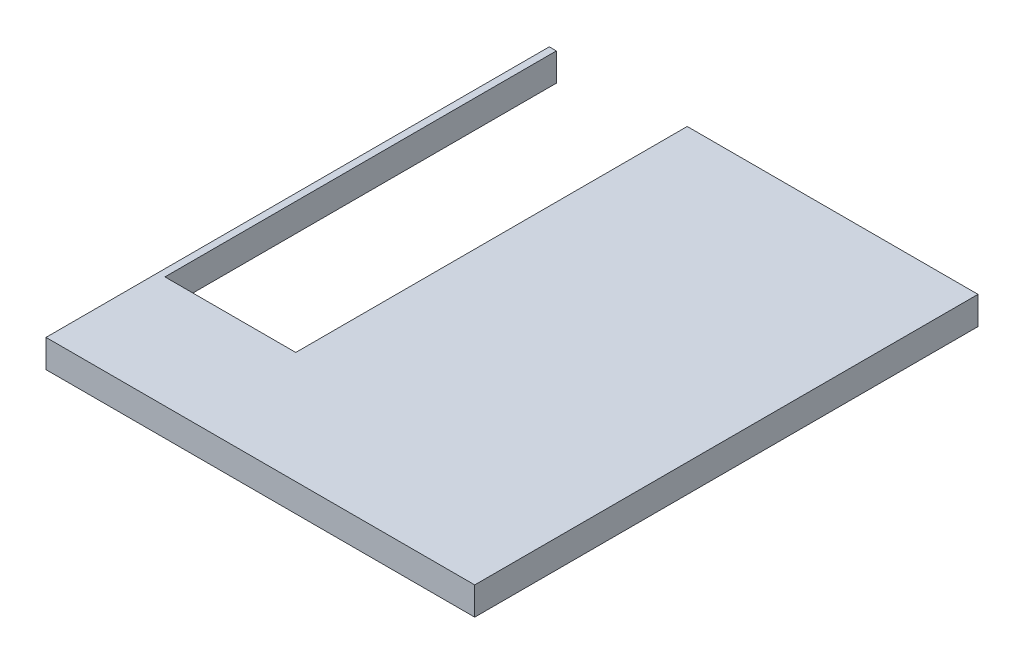
ISO-10303-21;
HEADER;
FILE_DESCRIPTION(('STEP AP214'),'2;1');
FILE_NAME('part.step','',(''),(''),'','','');
FILE_SCHEMA(('AUTOMOTIVE_DESIGN { 1 0 10303 214 1 1 1 1 }'));
ENDSEC;
DATA;
#1=APPLICATION_CONTEXT('core data for automotive mechanical design processes');
#2=APPLICATION_PROTOCOL_DEFINITION('international standard','automotive_design',2000,#1);
#3=PRODUCT_CONTEXT('',#1,'mechanical');
#4=PRODUCT('Part','Part','',(#3));
#5=PRODUCT_RELATED_PRODUCT_CATEGORY('part','',(#4));
#6=PRODUCT_DEFINITION_FORMATION('','',#4);
#7=PRODUCT_DEFINITION_CONTEXT('part definition',#1,'design');
#8=PRODUCT_DEFINITION('design','',#6,#7);
#9=PRODUCT_DEFINITION_SHAPE('','',#8);
#10=(LENGTH_UNIT() NAMED_UNIT(*) SI_UNIT(.MILLI.,.METRE.));
#11=(NAMED_UNIT(*) PLANE_ANGLE_UNIT() SI_UNIT($,.RADIAN.));
#12=(NAMED_UNIT(*) SI_UNIT($,.STERADIAN.) SOLID_ANGLE_UNIT());
#13=UNCERTAINTY_MEASURE_WITH_UNIT(LENGTH_MEASURE(1.E-05),#10,'distance_accuracy_value','');
#14=(GEOMETRIC_REPRESENTATION_CONTEXT(3) GLOBAL_UNCERTAINTY_ASSIGNED_CONTEXT((#13)) GLOBAL_UNIT_ASSIGNED_CONTEXT((#10,
#11,#12)) REPRESENTATION_CONTEXT('',''));
#15=CARTESIAN_POINT('',(0.,0.,0.));
#16=DIRECTION('',(0.,0.,1.));
#17=DIRECTION('',(1.,0.,0.));
#18=AXIS2_PLACEMENT_3D('',#15,#16,#17);
#19=CARTESIAN_POINT('',(0.,0.,0.));
#20=DIRECTION('',(0.,0.,-1.));
#21=DIRECTION('',(-1.,0.,0.));
#22=AXIS2_PLACEMENT_3D('',#19,#20,#21);
#23=PLANE('',#22);
#24=DIRECTION('',(0.,1.,0.));
#25=VECTOR('',#24,1.);
#26=CARTESIAN_POINT('',(740.,0.,0.));
#27=LINE('',#26,#25);
#28=CARTESIAN_POINT('',(740.,0.,0.));
#29=VERTEX_POINT('',#28);
#30=CARTESIAN_POINT('',(740.,150.,0.));
#31=VERTEX_POINT('',#30);
#32=EDGE_CURVE('E111',#29,#31,#27,.T.);
#33=ORIENTED_EDGE('',*,*,#32,.T.);
#34=DIRECTION('',(-1.,0.,0.));
#35=VECTOR('',#34,1.);
#36=CARTESIAN_POINT('',(0.,150.,0.));
#37=LINE('',#36,#35);
#38=CARTESIAN_POINT('',(2300.,150.,0.));
#39=VERTEX_POINT('',#38);
#40=EDGE_CURVE('E143',#39,#31,#37,.T.);
#41=ORIENTED_EDGE('',*,*,#40,.F.);
#42=DIRECTION('',(0.,1.,0.));
#43=VECTOR('',#42,1.);
#44=CARTESIAN_POINT('',(2300.,0.,0.));
#45=LINE('',#44,#43);
#46=CARTESIAN_POINT('',(2300.,0.,0.));
#47=VERTEX_POINT('',#46);
#48=EDGE_CURVE('E132',#47,#39,#45,.T.);
#49=ORIENTED_EDGE('',*,*,#48,.F.);
#50=DIRECTION('',(1.,0.,0.));
#51=VECTOR('',#50,1.);
#52=CARTESIAN_POINT('',(0.,0.,0.));
#53=LINE('',#52,#51);
#54=EDGE_CURVE('E126',#29,#47,#53,.T.);
#55=ORIENTED_EDGE('',*,*,#54,.F.);
#56=EDGE_LOOP('',(#33,#41,#49,#55));
#57=FACE_BOUND('',#56,.T.);
#58=ADVANCED_FACE('F37',(#57),#23,.T.);
#59=CARTESIAN_POINT('',(0.,0.,2700.));
#60=DIRECTION('',(1.,0.,0.));
#61=DIRECTION('',(0.,0.,-1.));
#62=AXIS2_PLACEMENT_3D('',#59,#60,#61);
#63=PLANE('',#62);
#64=DIRECTION('',(0.,-1.,0.));
#65=VECTOR('',#64,1.);
#66=CARTESIAN_POINT('',(0.,0.,0.));
#67=LINE('',#66,#65);
#68=CARTESIAN_POINT('',(0.,150.,0.));
#69=VERTEX_POINT('',#68);
#70=CARTESIAN_POINT('',(0.,0.,0.));
#71=VERTEX_POINT('',#70);
#72=EDGE_CURVE('E134',#69,#71,#67,.T.);
#73=ORIENTED_EDGE('',*,*,#72,.T.);
#74=DIRECTION('',(0.,0.,-1.));
#75=VECTOR('',#74,1.);
#76=CARTESIAN_POINT('',(0.,0.,2700.));
#77=LINE('',#76,#75);
#78=CARTESIAN_POINT('',(0.,0.,2700.));
#79=VERTEX_POINT('',#78);
#80=EDGE_CURVE('E11',#79,#71,#77,.T.);
#81=ORIENTED_EDGE('',*,*,#80,.F.);
#82=DIRECTION('',(0.,-1.,0.));
#83=VECTOR('',#82,1.);
#84=CARTESIAN_POINT('',(0.,0.,2700.));
#85=LINE('',#84,#83);
#86=CARTESIAN_POINT('',(0.,150.,2700.));
#87=VERTEX_POINT('',#86);
#88=EDGE_CURVE('E145',#87,#79,#85,.T.);
#89=ORIENTED_EDGE('',*,*,#88,.F.);
#90=DIRECTION('',(0.,0.,-1.));
#91=VECTOR('',#90,1.);
#92=CARTESIAN_POINT('',(0.,150.,2700.));
#93=LINE('',#92,#91);
#94=EDGE_CURVE('E146',#87,#69,#93,.T.);
#95=ORIENTED_EDGE('',*,*,#94,.T.);
#96=EDGE_LOOP('',(#73,#81,#89,#95));
#97=FACE_BOUND('',#96,.T.);
#98=ADVANCED_FACE('F39',(#97),#63,.F.);
#99=CARTESIAN_POINT('',(0.,0.,2700.));
#100=DIRECTION('',(0.,1.,0.));
#101=DIRECTION('',(0.,0.,1.));
#102=AXIS2_PLACEMENT_3D('',#99,#100,#101);
#103=PLANE('',#102);
#104=DIRECTION('',(1.,0.,0.));
#105=VECTOR('',#104,1.);
#106=CARTESIAN_POINT('',(740.,0.,2100.));
#107=LINE('',#106,#105);
#108=CARTESIAN_POINT('',(38.,0.,2100.));
#109=VERTEX_POINT('',#108);
#110=CARTESIAN_POINT('',(740.,0.,2100.));
#111=VERTEX_POINT('',#110);
#112=EDGE_CURVE('E123',#109,#111,#107,.T.);
#113=ORIENTED_EDGE('',*,*,#112,.T.);
#114=DIRECTION('',(0.,0.,-1.));
#115=VECTOR('',#114,1.);
#116=CARTESIAN_POINT('',(740.,0.,2100.));
#117=LINE('',#116,#115);
#118=EDGE_CURVE('E114',#111,#29,#117,.T.);
#119=ORIENTED_EDGE('',*,*,#118,.T.);
#120=ORIENTED_EDGE('',*,*,#54,.T.);
#121=DIRECTION('',(0.,0.,-1.));
#122=VECTOR('',#121,1.);
#123=CARTESIAN_POINT('',(2300.,0.,2700.));
#124=LINE('',#123,#122);
#125=CARTESIAN_POINT('',(2300.,0.,2700.));
#126=VERTEX_POINT('',#125);
#127=EDGE_CURVE('E45',#126,#47,#124,.T.);
#128=ORIENTED_EDGE('',*,*,#127,.F.);
#129=DIRECTION('',(1.,0.,0.));
#130=VECTOR('',#129,1.);
#131=CARTESIAN_POINT('',(0.,0.,2700.));
#132=LINE('',#131,#130);
#133=EDGE_CURVE('E89',#79,#126,#132,.T.);
#134=ORIENTED_EDGE('',*,*,#133,.F.);
#135=ORIENTED_EDGE('',*,*,#80,.T.);
#136=CARTESIAN_POINT('',(37.9999999999998,0.,0.));
#137=VERTEX_POINT('',#136);
#138=EDGE_CURVE('E133',#71,#137,#53,.T.);
#139=ORIENTED_EDGE('',*,*,#138,.T.);
#140=DIRECTION('',(0.,0.,1.));
#141=VECTOR('',#140,1.);
#142=CARTESIAN_POINT('',(38.,0.,2100.));
#143=LINE('',#142,#141);
#144=EDGE_CURVE('E52',#137,#109,#143,.T.);
#145=ORIENTED_EDGE('',*,*,#144,.T.);
#146=EDGE_LOOP('',(#113,#119,#120,#128,#134,#135,#139,#145));
#147=FACE_BOUND('',#146,.T.);
#148=ADVANCED_FACE('F125',(#147),#103,.F.);
#149=CARTESIAN_POINT('',(2300.,0.,2700.));
#150=DIRECTION('',(-1.,0.,0.));
#151=DIRECTION('',(0.,0.,1.));
#152=AXIS2_PLACEMENT_3D('',#149,#150,#151);
#153=PLANE('',#152);
#154=ORIENTED_EDGE('',*,*,#48,.T.);
#155=DIRECTION('',(0.,0.,-1.));
#156=VECTOR('',#155,1.);
#157=CARTESIAN_POINT('',(2300.,150.,2700.));
#158=LINE('',#157,#156);
#159=CARTESIAN_POINT('',(2300.,150.,2700.));
#160=VERTEX_POINT('',#159);
#161=EDGE_CURVE('E148',#160,#39,#158,.T.);
#162=ORIENTED_EDGE('',*,*,#161,.F.);
#163=DIRECTION('',(0.,1.,0.));
#164=VECTOR('',#163,1.);
#165=CARTESIAN_POINT('',(2300.,0.,2700.));
#166=LINE('',#165,#164);
#167=EDGE_CURVE('E154',#126,#160,#166,.T.);
#168=ORIENTED_EDGE('',*,*,#167,.F.);
#169=ORIENTED_EDGE('',*,*,#127,.T.);
#170=EDGE_LOOP('',(#154,#162,#168,#169));
#171=FACE_BOUND('',#170,.T.);
#172=ADVANCED_FACE('F152',(#171),#153,.F.);
#173=CARTESIAN_POINT('',(0.,150.,2700.));
#174=DIRECTION('',(0.,-1.,0.));
#175=DIRECTION('',(0.,0.,-1.));
#176=AXIS2_PLACEMENT_3D('',#173,#174,#175);
#177=PLANE('',#176);
#178=ORIENTED_EDGE('',*,*,#40,.T.);
#179=DIRECTION('',(0.,0.,-1.));
#180=VECTOR('',#179,1.);
#181=CARTESIAN_POINT('',(740.,150.,2100.));
#182=LINE('',#181,#180);
#183=CARTESIAN_POINT('',(740.,150.,2100.));
#184=VERTEX_POINT('',#183);
#185=EDGE_CURVE('E117',#184,#31,#182,.T.);
#186=ORIENTED_EDGE('',*,*,#185,.F.);
#187=DIRECTION('',(1.,0.,0.));
#188=VECTOR('',#187,1.);
#189=CARTESIAN_POINT('',(740.,150.,2100.));
#190=LINE('',#189,#188);
#191=CARTESIAN_POINT('',(38.,150.,2100.));
#192=VERTEX_POINT('',#191);
#193=EDGE_CURVE('E129',#192,#184,#190,.T.);
#194=ORIENTED_EDGE('',*,*,#193,.F.);
#195=DIRECTION('',(0.,0.,1.));
#196=VECTOR('',#195,1.);
#197=CARTESIAN_POINT('',(38.,150.,2100.));
#198=LINE('',#197,#196);
#199=CARTESIAN_POINT('',(37.9999999999998,150.,0.));
#200=VERTEX_POINT('',#199);
#201=EDGE_CURVE('E165',#200,#192,#198,.T.);
#202=ORIENTED_EDGE('',*,*,#201,.F.);
#203=EDGE_CURVE('E82',#200,#69,#37,.T.);
#204=ORIENTED_EDGE('',*,*,#203,.T.);
#205=ORIENTED_EDGE('',*,*,#94,.F.);
#206=DIRECTION('',(-1.,0.,0.));
#207=VECTOR('',#206,1.);
#208=CARTESIAN_POINT('',(0.,150.,2700.));
#209=LINE('',#208,#207);
#210=EDGE_CURVE('E61',#160,#87,#209,.T.);
#211=ORIENTED_EDGE('',*,*,#210,.F.);
#212=ORIENTED_EDGE('',*,*,#161,.T.);
#213=EDGE_LOOP('',(#178,#186,#194,#202,#204,#205,#211,#212));
#214=FACE_BOUND('',#213,.T.);
#215=ADVANCED_FACE('F176',(#214),#177,.F.);
#216=CARTESIAN_POINT('',(0.,0.,2700.));
#217=DIRECTION('',(0.,0.,-1.));
#218=DIRECTION('',(-1.,0.,0.));
#219=AXIS2_PLACEMENT_3D('',#216,#217,#218);
#220=PLANE('',#219);
#221=ORIENTED_EDGE('',*,*,#88,.T.);
#222=ORIENTED_EDGE('',*,*,#133,.T.);
#223=ORIENTED_EDGE('',*,*,#167,.T.);
#224=ORIENTED_EDGE('',*,*,#210,.T.);
#225=EDGE_LOOP('',(#221,#222,#223,#224));
#226=FACE_BOUND('',#225,.T.);
#227=ADVANCED_FACE('F196',(#226),#220,.F.);
#228=DIRECTION('',(0.,1.,0.));
#229=VECTOR('',#228,1.);
#230=CARTESIAN_POINT('',(37.9999999999998,0.,0.));
#231=LINE('',#230,#229);
#232=EDGE_CURVE('E122',#137,#200,#231,.T.);
#233=ORIENTED_EDGE('',*,*,#232,.F.);
#234=ORIENTED_EDGE('',*,*,#138,.F.);
#235=ORIENTED_EDGE('',*,*,#72,.F.);
#236=ORIENTED_EDGE('',*,*,#203,.F.);
#237=EDGE_LOOP('',(#233,#234,#235,#236));
#238=FACE_BOUND('',#237,.T.);
#239=ADVANCED_FACE('F173',(#238),#23,.T.);
#240=CARTESIAN_POINT('',(740.,0.,2100.));
#241=DIRECTION('',(1.,0.,0.));
#242=DIRECTION('',(0.,0.,-1.));
#243=AXIS2_PLACEMENT_3D('',#240,#241,#242);
#244=PLANE('',#243);
#245=ORIENTED_EDGE('',*,*,#185,.T.);
#246=ORIENTED_EDGE('',*,*,#32,.F.);
#247=ORIENTED_EDGE('',*,*,#118,.F.);
#248=DIRECTION('',(0.,1.,0.));
#249=VECTOR('',#248,1.);
#250=CARTESIAN_POINT('',(740.,0.,2100.));
#251=LINE('',#250,#249);
#252=EDGE_CURVE('E138',#111,#184,#251,.T.);
#253=ORIENTED_EDGE('',*,*,#252,.T.);
#254=EDGE_LOOP('',(#245,#246,#247,#253));
#255=FACE_BOUND('',#254,.T.);
#256=ADVANCED_FACE('F113',(#255),#244,.F.);
#257=CARTESIAN_POINT('',(740.,0.,2100.));
#258=DIRECTION('',(0.,0.,1.));
#259=DIRECTION('',(1.,0.,0.));
#260=AXIS2_PLACEMENT_3D('',#257,#258,#259);
#261=PLANE('',#260);
#262=ORIENTED_EDGE('',*,*,#193,.T.);
#263=ORIENTED_EDGE('',*,*,#252,.F.);
#264=ORIENTED_EDGE('',*,*,#112,.F.);
#265=DIRECTION('',(0.,1.,0.));
#266=VECTOR('',#265,1.);
#267=CARTESIAN_POINT('',(38.,0.,2100.));
#268=LINE('',#267,#266);
#269=EDGE_CURVE('E160',#109,#192,#268,.T.);
#270=ORIENTED_EDGE('',*,*,#269,.T.);
#271=EDGE_LOOP('',(#262,#263,#264,#270));
#272=FACE_BOUND('',#271,.T.);
#273=ADVANCED_FACE('F178',(#272),#261,.F.);
#274=CARTESIAN_POINT('',(38.,0.,2100.));
#275=DIRECTION('',(-1.,0.,0.));
#276=DIRECTION('',(0.,0.,1.));
#277=AXIS2_PLACEMENT_3D('',#274,#275,#276);
#278=PLANE('',#277);
#279=ORIENTED_EDGE('',*,*,#201,.T.);
#280=ORIENTED_EDGE('',*,*,#269,.F.);
#281=ORIENTED_EDGE('',*,*,#144,.F.);
#282=ORIENTED_EDGE('',*,*,#232,.T.);
#283=EDGE_LOOP('',(#279,#280,#281,#282));
#284=FACE_BOUND('',#283,.T.);
#285=ADVANCED_FACE('F174',(#284),#278,.F.);
#286=CLOSED_SHELL('',(#58,#98,#148,#172,#215,#227,#239,#256,#273,#285));
#287=MANIFOLD_SOLID_BREP('B2',#286);
#288=ADVANCED_BREP_SHAPE_REPRESENTATION('',(#18,#287),#14);
#289=SHAPE_DEFINITION_REPRESENTATION(#9,#288);
ENDSEC;
END-ISO-10303-21;
